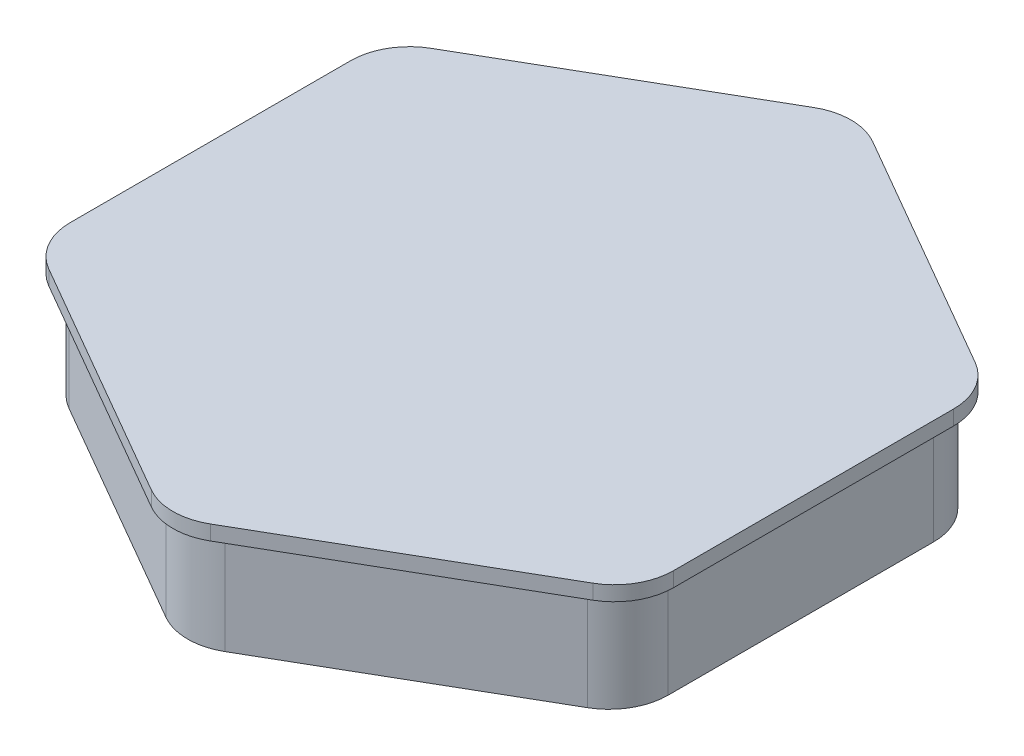
ISO-10303-21;
HEADER;
FILE_DESCRIPTION(('STEP AP214'),'2;1');
FILE_NAME('part.step','',(''),(''),'','','');
FILE_SCHEMA(('AUTOMOTIVE_DESIGN { 1 0 10303 214 1 1 1 1 }'));
ENDSEC;
DATA;
#1=APPLICATION_CONTEXT('core data for automotive mechanical design processes');
#2=APPLICATION_PROTOCOL_DEFINITION('international standard','automotive_design',2000,#1);
#3=PRODUCT_CONTEXT('',#1,'mechanical');
#4=PRODUCT('Part','Part','',(#3));
#5=PRODUCT_RELATED_PRODUCT_CATEGORY('part','',(#4));
#6=PRODUCT_DEFINITION_FORMATION('','',#4);
#7=PRODUCT_DEFINITION_CONTEXT('part definition',#1,'design');
#8=PRODUCT_DEFINITION('design','',#6,#7);
#9=PRODUCT_DEFINITION_SHAPE('','',#8);
#10=(LENGTH_UNIT() NAMED_UNIT(*) SI_UNIT(.MILLI.,.METRE.));
#11=(NAMED_UNIT(*) PLANE_ANGLE_UNIT() SI_UNIT($,.RADIAN.));
#12=(NAMED_UNIT(*) SI_UNIT($,.STERADIAN.) SOLID_ANGLE_UNIT());
#13=UNCERTAINTY_MEASURE_WITH_UNIT(LENGTH_MEASURE(1.E-05),#10,'distance_accuracy_value','');
#14=(GEOMETRIC_REPRESENTATION_CONTEXT(3) GLOBAL_UNCERTAINTY_ASSIGNED_CONTEXT((#13)) GLOBAL_UNIT_ASSIGNED_CONTEXT((#10,
#11,#12)) REPRESENTATION_CONTEXT('',''));
#15=CARTESIAN_POINT('',(0.,0.,0.));
#16=DIRECTION('',(0.,0.,1.));
#17=DIRECTION('',(1.,0.,0.));
#18=AXIS2_PLACEMENT_3D('',#15,#16,#17);
#19=CARTESIAN_POINT('',(23.3826859021798,24.6373706122073,-13.5));
#20=DIRECTION('',(0.,-1.,0.));
#21=DIRECTION('',(0.,0.,-1.));
#22=AXIS2_PLACEMENT_3D('',#19,#20,#21);
#23=CYLINDRICAL_SURFACE('',#22,6.);
#24=CARTESIAN_POINT('',(23.3826859021798,14.1373706122073,-13.5));
#25=DIRECTION('',(0.,1.,0.));
#26=DIRECTION('',(0.,0.,1.));
#27=AXIS2_PLACEMENT_3D('',#24,#25,#26);
#28=CIRCLE('',#27,6.);
#29=CARTESIAN_POINT('',(29.3826859021798,14.1373706122073,-13.5));
#30=VERTEX_POINT('',#29);
#31=CARTESIAN_POINT('',(26.3826859021798,14.1373706122073,-18.6961524227066));
#32=VERTEX_POINT('',#31);
#33=EDGE_CURVE('E179',#30,#32,#28,.T.);
#34=ORIENTED_EDGE('',*,*,#33,.T.);
#35=DIRECTION('',(0.,-1.,0.));
#36=VECTOR('',#35,1.);
#37=CARTESIAN_POINT('',(26.3826859021798,24.6373706122073,-18.6961524227066));
#38=LINE('',#37,#36);
#39=CARTESIAN_POINT('',(26.3826859021798,24.6373706122073,-18.6961524227066));
#40=VERTEX_POINT('',#39);
#41=EDGE_CURVE('E11',#40,#32,#38,.T.);
#42=ORIENTED_EDGE('',*,*,#41,.F.);
#43=CARTESIAN_POINT('',(23.3826859021798,24.6373706122073,-13.5));
#44=DIRECTION('',(0.,1.,0.));
#45=DIRECTION('',(0.,0.,1.));
#46=AXIS2_PLACEMENT_3D('',#43,#44,#45);
#47=CIRCLE('',#46,6.);
#48=CARTESIAN_POINT('',(29.3826859021798,24.6373706122073,-13.5));
#49=VERTEX_POINT('',#48);
#50=EDGE_CURVE('E214',#49,#40,#47,.T.);
#51=ORIENTED_EDGE('',*,*,#50,.F.);
#52=DIRECTION('',(0.,-1.,0.));
#53=VECTOR('',#52,1.);
#54=CARTESIAN_POINT('',(29.3826859021798,24.6373706122073,-13.5));
#55=LINE('',#54,#53);
#56=EDGE_CURVE('E178',#49,#30,#55,.T.);
#57=ORIENTED_EDGE('',*,*,#56,.T.);
#58=EDGE_LOOP('',(#34,#42,#51,#57));
#59=FACE_BOUND('',#58,.T.);
#60=ADVANCED_FACE('F40',(#59),#23,.T.);
#61=CARTESIAN_POINT('',(26.3826859021798,24.6373706122073,-18.6961524227066));
#62=DIRECTION('',(-0.499999999999999,0.,0.866025403784439));
#63=DIRECTION('',(0.866025403784439,0.,0.499999999999999));
#64=AXIS2_PLACEMENT_3D('',#61,#62,#63);
#65=PLANE('',#64);
#66=DIRECTION('',(-0.866025403784439,0.,-0.499999999999999));
#67=VECTOR('',#66,1.);
#68=CARTESIAN_POINT('',(26.3826859021798,14.1373706122073,-18.6961524227066));
#69=LINE('',#68,#67);
#70=CARTESIAN_POINT('',(2.99999999999999,14.1373706122073,-32.1961524227066));
#71=VERTEX_POINT('',#70);
#72=EDGE_CURVE('E183',#32,#71,#69,.T.);
#73=ORIENTED_EDGE('',*,*,#72,.T.);
#74=DIRECTION('',(0.,-1.,0.));
#75=VECTOR('',#74,1.);
#76=CARTESIAN_POINT('',(2.99999999999999,24.6373706122073,-32.1961524227066));
#77=LINE('',#76,#75);
#78=CARTESIAN_POINT('',(2.99999999999999,24.6373706122073,-32.1961524227066));
#79=VERTEX_POINT('',#78);
#80=EDGE_CURVE('E49',#79,#71,#77,.T.);
#81=ORIENTED_EDGE('',*,*,#80,.F.);
#82=DIRECTION('',(-0.866025403784439,0.,-0.499999999999999));
#83=VECTOR('',#82,1.);
#84=CARTESIAN_POINT('',(26.3826859021798,24.6373706122073,-18.6961524227066));
#85=LINE('',#84,#83);
#86=EDGE_CURVE('E111',#40,#79,#85,.T.);
#87=ORIENTED_EDGE('',*,*,#86,.F.);
#88=ORIENTED_EDGE('',*,*,#41,.T.);
#89=EDGE_LOOP('',(#73,#81,#87,#88));
#90=FACE_BOUND('',#89,.T.);
#91=ADVANCED_FACE('F498',(#90),#65,.F.);
#92=CARTESIAN_POINT('',(0.,24.6373706122073,-27.));
#93=DIRECTION('',(0.,-1.,0.));
#94=DIRECTION('',(0.,0.,-1.));
#95=AXIS2_PLACEMENT_3D('',#92,#93,#94);
#96=CYLINDRICAL_SURFACE('',#95,6.);
#97=CARTESIAN_POINT('',(0.,14.1373706122073,-27.));
#98=DIRECTION('',(0.,1.,0.));
#99=DIRECTION('',(0.,0.,-1.));
#100=AXIS2_PLACEMENT_3D('',#97,#98,#99);
#101=CIRCLE('',#100,6.);
#102=CARTESIAN_POINT('',(-3.00000000000001,14.1373706122073,-32.1961524227066));
#103=VERTEX_POINT('',#102);
#104=EDGE_CURVE('E187',#71,#103,#101,.T.);
#105=ORIENTED_EDGE('',*,*,#104,.T.);
#106=DIRECTION('',(0.,-1.,0.));
#107=VECTOR('',#106,1.);
#108=CARTESIAN_POINT('',(-3.00000000000001,24.6373706122073,-32.1961524227066));
#109=LINE('',#108,#107);
#110=CARTESIAN_POINT('',(-3.00000000000001,24.6373706122073,-32.1961524227066));
#111=VERTEX_POINT('',#110);
#112=EDGE_CURVE('E239',#111,#103,#109,.T.);
#113=ORIENTED_EDGE('',*,*,#112,.F.);
#114=CARTESIAN_POINT('',(0.,24.6373706122073,-27.));
#115=DIRECTION('',(0.,1.,0.));
#116=DIRECTION('',(0.,0.,-1.));
#117=AXIS2_PLACEMENT_3D('',#114,#115,#116);
#118=CIRCLE('',#117,6.);
#119=EDGE_CURVE('E249',#79,#111,#118,.T.);
#120=ORIENTED_EDGE('',*,*,#119,.F.);
#121=ORIENTED_EDGE('',*,*,#80,.T.);
#122=EDGE_LOOP('',(#105,#113,#120,#121));
#123=FACE_BOUND('',#122,.T.);
#124=ADVANCED_FACE('F247',(#123),#96,.T.);
#125=CARTESIAN_POINT('',(-3.00000000000001,24.6373706122073,-32.1961524227066));
#126=DIRECTION('',(0.5,0.,0.866025403784439));
#127=DIRECTION('',(0.866025403784439,0.,-0.5));
#128=AXIS2_PLACEMENT_3D('',#125,#126,#127);
#129=PLANE('',#128);
#130=DIRECTION('',(-0.866025403784439,0.,0.5));
#131=VECTOR('',#130,1.);
#132=CARTESIAN_POINT('',(-3.00000000000001,14.1373706122073,-32.1961524227066));
#133=LINE('',#132,#131);
#134=CARTESIAN_POINT('',(-26.3826859021798,14.1373706122073,-18.6961524227066));
#135=VERTEX_POINT('',#134);
#136=EDGE_CURVE('E190',#103,#135,#133,.T.);
#137=ORIENTED_EDGE('',*,*,#136,.T.);
#138=DIRECTION('',(0.,-1.,0.));
#139=VECTOR('',#138,1.);
#140=CARTESIAN_POINT('',(-26.3826859021798,24.6373706122073,-18.6961524227066));
#141=LINE('',#140,#139);
#142=CARTESIAN_POINT('',(-26.3826859021798,24.6373706122073,-18.6961524227066));
#143=VERTEX_POINT('',#142);
#144=EDGE_CURVE('E235',#143,#135,#141,.T.);
#145=ORIENTED_EDGE('',*,*,#144,.F.);
#146=DIRECTION('',(-0.866025403784439,0.,0.5));
#147=VECTOR('',#146,1.);
#148=CARTESIAN_POINT('',(-3.00000000000001,24.6373706122073,-32.1961524227066));
#149=LINE('',#148,#147);
#150=EDGE_CURVE('E269',#111,#143,#149,.T.);
#151=ORIENTED_EDGE('',*,*,#150,.F.);
#152=ORIENTED_EDGE('',*,*,#112,.T.);
#153=EDGE_LOOP('',(#137,#145,#151,#152));
#154=FACE_BOUND('',#153,.T.);
#155=ADVANCED_FACE('F257',(#154),#129,.F.);
#156=CARTESIAN_POINT('',(-23.3826859021798,24.6373706122073,-13.5));
#157=DIRECTION('',(0.,-1.,0.));
#158=DIRECTION('',(0.,0.,-1.));
#159=AXIS2_PLACEMENT_3D('',#156,#157,#158);
#160=CYLINDRICAL_SURFACE('',#159,6.);
#161=CARTESIAN_POINT('',(-23.3826859021798,14.1373706122073,-13.5));
#162=DIRECTION('',(0.,1.,0.));
#163=DIRECTION('',(0.,0.,1.));
#164=AXIS2_PLACEMENT_3D('',#161,#162,#163);
#165=CIRCLE('',#164,6.);
#166=CARTESIAN_POINT('',(-29.3826859021798,14.1373706122073,-13.5));
#167=VERTEX_POINT('',#166);
#168=EDGE_CURVE('E193',#135,#167,#165,.T.);
#169=ORIENTED_EDGE('',*,*,#168,.T.);
#170=DIRECTION('',(0.,-1.,0.));
#171=VECTOR('',#170,1.);
#172=CARTESIAN_POINT('',(-29.3826859021798,24.6373706122073,-13.5));
#173=LINE('',#172,#171);
#174=CARTESIAN_POINT('',(-29.3826859021798,24.6373706122073,-13.5));
#175=VERTEX_POINT('',#174);
#176=EDGE_CURVE('E231',#175,#167,#173,.T.);
#177=ORIENTED_EDGE('',*,*,#176,.F.);
#178=CARTESIAN_POINT('',(-23.3826859021798,24.6373706122073,-13.5));
#179=DIRECTION('',(0.,1.,0.));
#180=DIRECTION('',(0.,0.,1.));
#181=AXIS2_PLACEMENT_3D('',#178,#179,#180);
#182=CIRCLE('',#181,6.);
#183=EDGE_CURVE('E263',#143,#175,#182,.T.);
#184=ORIENTED_EDGE('',*,*,#183,.F.);
#185=ORIENTED_EDGE('',*,*,#144,.T.);
#186=EDGE_LOOP('',(#169,#177,#184,#185));
#187=FACE_BOUND('',#186,.T.);
#188=ADVANCED_FACE('F261',(#187),#160,.T.);
#189=CARTESIAN_POINT('',(-29.3826859021798,24.6373706122073,-13.5));
#190=DIRECTION('',(1.,0.,0.));
#191=DIRECTION('',(0.,0.,-1.));
#192=AXIS2_PLACEMENT_3D('',#189,#190,#191);
#193=PLANE('',#192);
#194=DIRECTION('',(0.,0.,1.));
#195=VECTOR('',#194,1.);
#196=CARTESIAN_POINT('',(-29.3826859021798,14.1373706122073,-13.5));
#197=LINE('',#196,#195);
#198=CARTESIAN_POINT('',(-29.3826859021798,14.1373706122073,13.5));
#199=VERTEX_POINT('',#198);
#200=EDGE_CURVE('E196',#167,#199,#197,.T.);
#201=ORIENTED_EDGE('',*,*,#200,.T.);
#202=DIRECTION('',(0.,-1.,0.));
#203=VECTOR('',#202,1.);
#204=CARTESIAN_POINT('',(-29.3826859021798,24.6373706122073,13.5));
#205=LINE('',#204,#203);
#206=CARTESIAN_POINT('',(-29.3826859021798,24.6373706122073,13.5));
#207=VERTEX_POINT('',#206);
#208=EDGE_CURVE('E227',#207,#199,#205,.T.);
#209=ORIENTED_EDGE('',*,*,#208,.F.);
#210=DIRECTION('',(0.,0.,1.));
#211=VECTOR('',#210,1.);
#212=CARTESIAN_POINT('',(-29.3826859021798,24.6373706122073,-13.5));
#213=LINE('',#212,#211);
#214=EDGE_CURVE('E268',#175,#207,#213,.T.);
#215=ORIENTED_EDGE('',*,*,#214,.F.);
#216=ORIENTED_EDGE('',*,*,#176,.T.);
#217=EDGE_LOOP('',(#201,#209,#215,#216));
#218=FACE_BOUND('',#217,.T.);
#219=ADVANCED_FACE('F511',(#218),#193,.F.);
#220=CARTESIAN_POINT('',(-23.3826859021798,24.6373706122073,13.5));
#221=DIRECTION('',(0.,-1.,0.));
#222=DIRECTION('',(0.,0.,-1.));
#223=AXIS2_PLACEMENT_3D('',#220,#221,#222);
#224=CYLINDRICAL_SURFACE('',#223,6.);
#225=CARTESIAN_POINT('',(-23.3826859021798,14.1373706122073,13.5));
#226=DIRECTION('',(0.,1.,0.));
#227=DIRECTION('',(0.,0.,1.));
#228=AXIS2_PLACEMENT_3D('',#225,#226,#227);
#229=CIRCLE('',#228,6.);
#230=CARTESIAN_POINT('',(-26.3826859021798,14.1373706122073,18.6961524227066));
#231=VERTEX_POINT('',#230);
#232=EDGE_CURVE('E199',#199,#231,#229,.T.);
#233=ORIENTED_EDGE('',*,*,#232,.T.);
#234=DIRECTION('',(0.,-1.,0.));
#235=VECTOR('',#234,1.);
#236=CARTESIAN_POINT('',(-26.3826859021798,24.6373706122073,18.6961524227066));
#237=LINE('',#236,#235);
#238=CARTESIAN_POINT('',(-26.3826859021798,24.6373706122073,18.6961524227066));
#239=VERTEX_POINT('',#238);
#240=EDGE_CURVE('E223',#239,#231,#237,.T.);
#241=ORIENTED_EDGE('',*,*,#240,.F.);
#242=CARTESIAN_POINT('',(-23.3826859021798,24.6373706122073,13.5));
#243=DIRECTION('',(0.,1.,0.));
#244=DIRECTION('',(0.,0.,1.));
#245=AXIS2_PLACEMENT_3D('',#242,#243,#244);
#246=CIRCLE('',#245,6.);
#247=EDGE_CURVE('E169',#207,#239,#246,.T.);
#248=ORIENTED_EDGE('',*,*,#247,.F.);
#249=ORIENTED_EDGE('',*,*,#208,.T.);
#250=EDGE_LOOP('',(#233,#241,#248,#249));
#251=FACE_BOUND('',#250,.T.);
#252=ADVANCED_FACE('F281',(#251),#224,.T.);
#253=CARTESIAN_POINT('',(-26.3826859021798,24.6373706122073,18.6961524227066));
#254=DIRECTION('',(0.499999999999999,0.,-0.866025403784439));
#255=DIRECTION('',(-0.866025403784439,0.,-0.499999999999999));
#256=AXIS2_PLACEMENT_3D('',#253,#254,#255);
#257=PLANE('',#256);
#258=DIRECTION('',(0.866025403784439,0.,0.499999999999999));
#259=VECTOR('',#258,1.);
#260=CARTESIAN_POINT('',(-26.3826859021798,14.1373706122073,18.6961524227066));
#261=LINE('',#260,#259);
#262=CARTESIAN_POINT('',(-2.99999999999998,14.1373706122073,32.1961524227066));
#263=VERTEX_POINT('',#262);
#264=EDGE_CURVE('E202',#231,#263,#261,.T.);
#265=ORIENTED_EDGE('',*,*,#264,.T.);
#266=DIRECTION('',(0.,-1.,0.));
#267=VECTOR('',#266,1.);
#268=CARTESIAN_POINT('',(-2.99999999999998,24.6373706122073,32.1961524227066));
#269=LINE('',#268,#267);
#270=CARTESIAN_POINT('',(-2.99999999999998,24.6373706122073,32.1961524227066));
#271=VERTEX_POINT('',#270);
#272=EDGE_CURVE('E150',#271,#263,#269,.T.);
#273=ORIENTED_EDGE('',*,*,#272,.F.);
#274=DIRECTION('',(0.866025403784439,0.,0.499999999999999));
#275=VECTOR('',#274,1.);
#276=CARTESIAN_POINT('',(-26.3826859021798,24.6373706122073,18.6961524227066));
#277=LINE('',#276,#275);
#278=EDGE_CURVE('E165',#239,#271,#277,.T.);
#279=ORIENTED_EDGE('',*,*,#278,.F.);
#280=ORIENTED_EDGE('',*,*,#240,.T.);
#281=EDGE_LOOP('',(#265,#273,#279,#280));
#282=FACE_BOUND('',#281,.T.);
#283=ADVANCED_FACE('F285',(#282),#257,.F.);
#284=CARTESIAN_POINT('',(0.,24.6373706122073,27.));
#285=DIRECTION('',(0.,-1.,0.));
#286=DIRECTION('',(0.,0.,-1.));
#287=AXIS2_PLACEMENT_3D('',#284,#285,#286);
#288=CYLINDRICAL_SURFACE('',#287,6.);
#289=CARTESIAN_POINT('',(0.,14.1373706122073,27.));
#290=DIRECTION('',(0.,1.,0.));
#291=DIRECTION('',(0.,0.,1.));
#292=AXIS2_PLACEMENT_3D('',#289,#290,#291);
#293=CIRCLE('',#292,6.);
#294=CARTESIAN_POINT('',(3.00000000000002,14.1373706122073,32.1961524227066));
#295=VERTEX_POINT('',#294);
#296=EDGE_CURVE('E146',#263,#295,#293,.T.);
#297=ORIENTED_EDGE('',*,*,#296,.T.);
#298=DIRECTION('',(0.,-1.,0.));
#299=VECTOR('',#298,1.);
#300=CARTESIAN_POINT('',(3.00000000000002,24.6373706122073,32.1961524227066));
#301=LINE('',#300,#299);
#302=CARTESIAN_POINT('',(3.00000000000002,24.6373706122073,32.1961524227066));
#303=VERTEX_POINT('',#302);
#304=EDGE_CURVE('E138',#303,#295,#301,.T.);
#305=ORIENTED_EDGE('',*,*,#304,.F.);
#306=CARTESIAN_POINT('',(0.,24.6373706122073,27.));
#307=DIRECTION('',(0.,1.,0.));
#308=DIRECTION('',(0.,0.,1.));
#309=AXIS2_PLACEMENT_3D('',#306,#307,#308);
#310=CIRCLE('',#309,6.);
#311=EDGE_CURVE('E143',#271,#303,#310,.T.);
#312=ORIENTED_EDGE('',*,*,#311,.F.);
#313=ORIENTED_EDGE('',*,*,#272,.T.);
#314=EDGE_LOOP('',(#297,#305,#312,#313));
#315=FACE_BOUND('',#314,.T.);
#316=ADVANCED_FACE('F140',(#315),#288,.T.);
#317=CARTESIAN_POINT('',(3.00000000000002,24.6373706122073,32.1961524227066));
#318=DIRECTION('',(-0.5,0.,-0.866025403784439));
#319=DIRECTION('',(-0.866025403784439,0.,0.5));
#320=AXIS2_PLACEMENT_3D('',#317,#318,#319);
#321=PLANE('',#320);
#322=DIRECTION('',(0.866025403784439,0.,-0.5));
#323=VECTOR('',#322,1.);
#324=CARTESIAN_POINT('',(3.00000000000002,14.1373706122073,32.1961524227066));
#325=LINE('',#324,#323);
#326=CARTESIAN_POINT('',(26.3826859021798,14.1373706122073,18.6961524227066));
#327=VERTEX_POINT('',#326);
#328=EDGE_CURVE('E207',#295,#327,#325,.T.);
#329=ORIENTED_EDGE('',*,*,#328,.T.);
#330=DIRECTION('',(0.,-1.,0.));
#331=VECTOR('',#330,1.);
#332=CARTESIAN_POINT('',(26.3826859021798,24.6373706122073,18.6961524227066));
#333=LINE('',#332,#331);
#334=CARTESIAN_POINT('',(26.3826859021798,24.6373706122073,18.6961524227066));
#335=VERTEX_POINT('',#334);
#336=EDGE_CURVE('E151',#335,#327,#333,.T.);
#337=ORIENTED_EDGE('',*,*,#336,.F.);
#338=DIRECTION('',(0.866025403784439,0.,-0.5));
#339=VECTOR('',#338,1.);
#340=CARTESIAN_POINT('',(3.00000000000002,24.6373706122073,32.1961524227066));
#341=LINE('',#340,#339);
#342=EDGE_CURVE('E154',#303,#335,#341,.T.);
#343=ORIENTED_EDGE('',*,*,#342,.F.);
#344=ORIENTED_EDGE('',*,*,#304,.T.);
#345=EDGE_LOOP('',(#329,#337,#343,#344));
#346=FACE_BOUND('',#345,.T.);
#347=ADVANCED_FACE('F155',(#346),#321,.F.);
#348=CARTESIAN_POINT('',(23.3826859021798,24.6373706122073,13.5));
#349=DIRECTION('',(0.,-1.,0.));
#350=DIRECTION('',(0.,0.,-1.));
#351=AXIS2_PLACEMENT_3D('',#348,#349,#350);
#352=CYLINDRICAL_SURFACE('',#351,6.);
#353=CARTESIAN_POINT('',(23.3826859021798,14.1373706122073,13.5));
#354=DIRECTION('',(0.,1.,0.));
#355=DIRECTION('',(0.,0.,1.));
#356=AXIS2_PLACEMENT_3D('',#353,#354,#355);
#357=CIRCLE('',#356,6.);
#358=CARTESIAN_POINT('',(29.3826859021798,14.1373706122073,13.5));
#359=VERTEX_POINT('',#358);
#360=EDGE_CURVE('E97',#327,#359,#357,.T.);
#361=ORIENTED_EDGE('',*,*,#360,.T.);
#362=DIRECTION('',(0.,-1.,0.));
#363=VECTOR('',#362,1.);
#364=CARTESIAN_POINT('',(29.3826859021798,24.6373706122073,13.5));
#365=LINE('',#364,#363);
#366=CARTESIAN_POINT('',(29.3826859021798,24.6373706122073,13.5));
#367=VERTEX_POINT('',#366);
#368=EDGE_CURVE('E57',#367,#359,#365,.T.);
#369=ORIENTED_EDGE('',*,*,#368,.F.);
#370=CARTESIAN_POINT('',(23.3826859021798,24.6373706122073,13.5));
#371=DIRECTION('',(0.,1.,0.));
#372=DIRECTION('',(0.,0.,1.));
#373=AXIS2_PLACEMENT_3D('',#370,#371,#372);
#374=CIRCLE('',#373,6.);
#375=EDGE_CURVE('E159',#335,#367,#374,.T.);
#376=ORIENTED_EDGE('',*,*,#375,.F.);
#377=ORIENTED_EDGE('',*,*,#336,.T.);
#378=EDGE_LOOP('',(#361,#369,#376,#377));
#379=FACE_BOUND('',#378,.T.);
#380=ADVANCED_FACE('F286',(#379),#352,.T.);
#381=CARTESIAN_POINT('',(29.3826859021798,24.6373706122073,13.5));
#382=DIRECTION('',(-1.,0.,0.));
#383=DIRECTION('',(0.,0.,1.));
#384=AXIS2_PLACEMENT_3D('',#381,#382,#383);
#385=PLANE('',#384);
#386=DIRECTION('',(0.,0.,-1.));
#387=VECTOR('',#386,1.);
#388=CARTESIAN_POINT('',(29.3826859021798,14.1373706122073,13.5));
#389=LINE('',#388,#387);
#390=EDGE_CURVE('E103',#359,#30,#389,.T.);
#391=ORIENTED_EDGE('',*,*,#390,.T.);
#392=ORIENTED_EDGE('',*,*,#56,.F.);
#393=DIRECTION('',(0.,0.,-1.));
#394=VECTOR('',#393,1.);
#395=CARTESIAN_POINT('',(29.3826859021798,24.6373706122073,13.5));
#396=LINE('',#395,#394);
#397=EDGE_CURVE('E175',#367,#49,#396,.T.);
#398=ORIENTED_EDGE('',*,*,#397,.F.);
#399=ORIENTED_EDGE('',*,*,#368,.T.);
#400=EDGE_LOOP('',(#391,#392,#398,#399));
#401=FACE_BOUND('',#400,.T.);
#402=ADVANCED_FACE('F290',(#401),#385,.F.);
#403=CARTESIAN_POINT('',(23.3826859021798,14.1373706122073,-13.5));
#404=DIRECTION('',(0.,1.,0.));
#405=DIRECTION('',(0.,0.,1.));
#406=AXIS2_PLACEMENT_3D('',#403,#404,#405);
#407=PLANE('',#406);
#408=ORIENTED_EDGE('',*,*,#33,.F.);
#409=ORIENTED_EDGE('',*,*,#390,.F.);
#410=ORIENTED_EDGE('',*,*,#360,.F.);
#411=ORIENTED_EDGE('',*,*,#328,.F.);
#412=ORIENTED_EDGE('',*,*,#296,.F.);
#413=ORIENTED_EDGE('',*,*,#264,.F.);
#414=ORIENTED_EDGE('',*,*,#232,.F.);
#415=ORIENTED_EDGE('',*,*,#200,.F.);
#416=ORIENTED_EDGE('',*,*,#168,.F.);
#417=ORIENTED_EDGE('',*,*,#136,.F.);
#418=ORIENTED_EDGE('',*,*,#104,.F.);
#419=ORIENTED_EDGE('',*,*,#72,.F.);
#420=EDGE_LOOP('',(#408,#409,#410,#411,#412,#413,#414,#415,#416,#417,#418,#419));
#421=FACE_BOUND('',#420,.T.);
#422=ADVANCED_FACE('F253',(#421),#407,.F.);
#423=CARTESIAN_POINT('',(24.6817240078565,24.6373706122073,-14.25));
#424=DIRECTION('',(0.,1.,0.));
#425=DIRECTION('',(0.,0.,1.));
#426=AXIS2_PLACEMENT_3D('',#423,#424,#425);
#427=PLANE('',#426);
#428=CARTESIAN_POINT('',(24.6817240078565,24.6373706122073,-14.25));
#429=DIRECTION('',(0.,1.,0.));
#430=DIRECTION('',(0.,0.,1.));
#431=AXIS2_PLACEMENT_3D('',#428,#429,#430);
#432=CIRCLE('',#431,6.);
#433=CARTESIAN_POINT('',(30.6817240078565,24.6373706122073,-14.25));
#434=VERTEX_POINT('',#433);
#435=CARTESIAN_POINT('',(27.6817240078565,24.6373706122073,-19.4461524227066));
#436=VERTEX_POINT('',#435);
#437=EDGE_CURVE('E389',#434,#436,#432,.T.);
#438=ORIENTED_EDGE('',*,*,#437,.F.);
#439=DIRECTION('',(0.,0.,-1.));
#440=VECTOR('',#439,1.);
#441=CARTESIAN_POINT('',(30.6817240078565,24.6373706122073,14.25));
#442=LINE('',#441,#440);
#443=CARTESIAN_POINT('',(30.6817240078565,24.6373706122073,14.25));
#444=VERTEX_POINT('',#443);
#445=EDGE_CURVE('E344',#444,#434,#442,.T.);
#446=ORIENTED_EDGE('',*,*,#445,.F.);
#447=CARTESIAN_POINT('',(24.6817240078565,24.6373706122073,14.25));
#448=DIRECTION('',(0.,1.,0.));
#449=DIRECTION('',(0.,0.,1.));
#450=AXIS2_PLACEMENT_3D('',#447,#448,#449);
#451=CIRCLE('',#450,6.);
#452=CARTESIAN_POINT('',(27.6817240078565,24.6373706122073,19.4461524227066));
#453=VERTEX_POINT('',#452);
#454=EDGE_CURVE('E349',#453,#444,#451,.T.);
#455=ORIENTED_EDGE('',*,*,#454,.F.);
#456=DIRECTION('',(0.866025403784438,0.,-0.5));
#457=VECTOR('',#456,1.);
#458=CARTESIAN_POINT('',(3.00000000000001,24.6373706122073,33.6961524227066));
#459=LINE('',#458,#457);
#460=CARTESIAN_POINT('',(3.00000000000001,24.6373706122073,33.6961524227066));
#461=VERTEX_POINT('',#460);
#462=EDGE_CURVE('E353',#461,#453,#459,.T.);
#463=ORIENTED_EDGE('',*,*,#462,.F.);
#464=CARTESIAN_POINT('',(0.,24.6373706122073,28.5));
#465=DIRECTION('',(0.,1.,0.));
#466=DIRECTION('',(0.,0.,1.));
#467=AXIS2_PLACEMENT_3D('',#464,#465,#466);
#468=CIRCLE('',#467,6.);
#469=CARTESIAN_POINT('',(-2.99999999999999,24.6373706122073,33.6961524227066));
#470=VERTEX_POINT('',#469);
#471=EDGE_CURVE('E357',#470,#461,#468,.T.);
#472=ORIENTED_EDGE('',*,*,#471,.F.);
#473=DIRECTION('',(0.866025403784439,0.,0.499999999999999));
#474=VECTOR('',#473,1.);
#475=CARTESIAN_POINT('',(-27.6817240078565,24.6373706122073,19.4461524227067));
#476=LINE('',#475,#474);
#477=CARTESIAN_POINT('',(-27.6817240078565,24.6373706122073,19.4461524227067));
#478=VERTEX_POINT('',#477);
#479=EDGE_CURVE('E361',#478,#470,#476,.T.);
#480=ORIENTED_EDGE('',*,*,#479,.F.);
#481=CARTESIAN_POINT('',(-24.6817240078565,24.6373706122073,14.25));
#482=DIRECTION('',(0.,1.,0.));
#483=DIRECTION('',(0.,0.,1.));
#484=AXIS2_PLACEMENT_3D('',#481,#482,#483);
#485=CIRCLE('',#484,6.);
#486=CARTESIAN_POINT('',(-30.6817240078565,24.6373706122073,14.25));
#487=VERTEX_POINT('',#486);
#488=EDGE_CURVE('E365',#487,#478,#485,.T.);
#489=ORIENTED_EDGE('',*,*,#488,.F.);
#490=DIRECTION('',(0.,0.,1.));
#491=VECTOR('',#490,1.);
#492=CARTESIAN_POINT('',(-30.6817240078565,24.6373706122073,-14.25));
#493=LINE('',#492,#491);
#494=CARTESIAN_POINT('',(-30.6817240078565,24.6373706122073,-14.25));
#495=VERTEX_POINT('',#494);
#496=EDGE_CURVE('E369',#495,#487,#493,.T.);
#497=ORIENTED_EDGE('',*,*,#496,.F.);
#498=CARTESIAN_POINT('',(-24.6817240078565,24.6373706122073,-14.25));
#499=DIRECTION('',(0.,1.,0.));
#500=DIRECTION('',(0.,0.,1.));
#501=AXIS2_PLACEMENT_3D('',#498,#499,#500);
#502=CIRCLE('',#501,6.);
#503=CARTESIAN_POINT('',(-27.6817240078565,24.6373706122073,-19.4461524227066));
#504=VERTEX_POINT('',#503);
#505=EDGE_CURVE('E373',#504,#495,#502,.T.);
#506=ORIENTED_EDGE('',*,*,#505,.F.);
#507=DIRECTION('',(-0.866025403784439,0.,0.5));
#508=VECTOR('',#507,1.);
#509=CARTESIAN_POINT('',(-3.,24.6373706122073,-33.6961524227066));
#510=LINE('',#509,#508);
#511=CARTESIAN_POINT('',(-3.,24.6373706122073,-33.6961524227066));
#512=VERTEX_POINT('',#511);
#513=EDGE_CURVE('E377',#512,#504,#510,.T.);
#514=ORIENTED_EDGE('',*,*,#513,.F.);
#515=CARTESIAN_POINT('',(0.,24.6373706122073,-28.5));
#516=DIRECTION('',(0.,1.,0.));
#517=DIRECTION('',(0.,0.,-1.));
#518=AXIS2_PLACEMENT_3D('',#515,#516,#517);
#519=CIRCLE('',#518,6.);
#520=CARTESIAN_POINT('',(2.99999999999999,24.6373706122073,-33.6961524227066));
#521=VERTEX_POINT('',#520);
#522=EDGE_CURVE('E381',#521,#512,#519,.T.);
#523=ORIENTED_EDGE('',*,*,#522,.F.);
#524=DIRECTION('',(-0.866025403784439,0.,-0.499999999999999));
#525=VECTOR('',#524,1.);
#526=CARTESIAN_POINT('',(27.6817240078565,24.6373706122073,-19.4461524227066));
#527=LINE('',#526,#525);
#528=EDGE_CURVE('E385',#436,#521,#527,.T.);
#529=ORIENTED_EDGE('',*,*,#528,.F.);
#530=EDGE_LOOP('',(#438,#446,#455,#463,#472,#480,#489,#497,#506,#514,#523,#529));
#531=FACE_BOUND('',#530,.T.);
#532=ORIENTED_EDGE('',*,*,#397,.T.);
#533=ORIENTED_EDGE('',*,*,#50,.T.);
#534=ORIENTED_EDGE('',*,*,#86,.T.);
#535=ORIENTED_EDGE('',*,*,#119,.T.);
#536=ORIENTED_EDGE('',*,*,#150,.T.);
#537=ORIENTED_EDGE('',*,*,#183,.T.);
#538=ORIENTED_EDGE('',*,*,#214,.T.);
#539=ORIENTED_EDGE('',*,*,#247,.T.);
#540=ORIENTED_EDGE('',*,*,#278,.T.);
#541=ORIENTED_EDGE('',*,*,#311,.T.);
#542=ORIENTED_EDGE('',*,*,#342,.T.);
#543=ORIENTED_EDGE('',*,*,#375,.T.);
#544=EDGE_LOOP('',(#532,#533,#534,#535,#536,#537,#538,#539,#540,#541,#542,#543));
#545=FACE_BOUND('',#544,.T.);
#546=ADVANCED_FACE('F162',(#531,#545),#427,.F.);
#547=CARTESIAN_POINT('',(24.6817240078565,26.1373706122073,-14.25));
#548=DIRECTION('',(0.,-1.,0.));
#549=DIRECTION('',(0.,0.,-1.));
#550=AXIS2_PLACEMENT_3D('',#547,#548,#549);
#551=CYLINDRICAL_SURFACE('',#550,6.);
#552=ORIENTED_EDGE('',*,*,#437,.T.);
#553=DIRECTION('',(0.,-1.,0.));
#554=VECTOR('',#553,1.);
#555=CARTESIAN_POINT('',(27.6817240078565,26.1373706122073,-19.4461524227066));
#556=LINE('',#555,#554);
#557=CARTESIAN_POINT('',(27.6817240078565,26.1373706122073,-19.4461524227066));
#558=VERTEX_POINT('',#557);
#559=EDGE_CURVE('E184',#558,#436,#556,.T.);
#560=ORIENTED_EDGE('',*,*,#559,.F.);
#561=CARTESIAN_POINT('',(24.6817240078565,26.1373706122073,-14.25));
#562=DIRECTION('',(0.,1.,0.));
#563=DIRECTION('',(0.,0.,1.));
#564=AXIS2_PLACEMENT_3D('',#561,#562,#563);
#565=CIRCLE('',#564,6.);
#566=CARTESIAN_POINT('',(30.6817240078565,26.1373706122073,-14.25));
#567=VERTEX_POINT('',#566);
#568=EDGE_CURVE('E348',#567,#558,#565,.T.);
#569=ORIENTED_EDGE('',*,*,#568,.F.);
#570=DIRECTION('',(0.,-1.,0.));
#571=VECTOR('',#570,1.);
#572=CARTESIAN_POINT('',(30.6817240078565,26.1373706122073,-14.25));
#573=LINE('',#572,#571);
#574=EDGE_CURVE('E339',#567,#434,#573,.T.);
#575=ORIENTED_EDGE('',*,*,#574,.T.);
#576=EDGE_LOOP('',(#552,#560,#569,#575));
#577=FACE_BOUND('',#576,.T.);
#578=ADVANCED_FACE('F451',(#577),#551,.T.);
#579=CARTESIAN_POINT('',(27.6817240078565,26.1373706122073,-19.4461524227066));
#580=DIRECTION('',(-0.499999999999999,0.,0.866025403784439));
#581=DIRECTION('',(0.866025403784439,0.,0.499999999999999));
#582=AXIS2_PLACEMENT_3D('',#579,#580,#581);
#583=PLANE('',#582);
#584=ORIENTED_EDGE('',*,*,#528,.T.);
#585=DIRECTION('',(0.,-1.,0.));
#586=VECTOR('',#585,1.);
#587=CARTESIAN_POINT('',(2.99999999999999,26.1373706122073,-33.6961524227066));
#588=LINE('',#587,#586);
#589=CARTESIAN_POINT('',(2.99999999999999,26.1373706122073,-33.6961524227066));
#590=VERTEX_POINT('',#589);
#591=EDGE_CURVE('E299',#590,#521,#588,.T.);
#592=ORIENTED_EDGE('',*,*,#591,.F.);
#593=DIRECTION('',(-0.866025403784439,0.,-0.499999999999999));
#594=VECTOR('',#593,1.);
#595=CARTESIAN_POINT('',(27.6817240078565,26.1373706122073,-19.4461524227066));
#596=LINE('',#595,#594);
#597=EDGE_CURVE('E432',#558,#590,#596,.T.);
#598=ORIENTED_EDGE('',*,*,#597,.F.);
#599=ORIENTED_EDGE('',*,*,#559,.T.);
#600=EDGE_LOOP('',(#584,#592,#598,#599));
#601=FACE_BOUND('',#600,.T.);
#602=ADVANCED_FACE('F455',(#601),#583,.F.);
#603=CARTESIAN_POINT('',(0.,26.1373706122073,-28.5));
#604=DIRECTION('',(0.,-1.,0.));
#605=DIRECTION('',(0.,0.,-1.));
#606=AXIS2_PLACEMENT_3D('',#603,#604,#605);
#607=CYLINDRICAL_SURFACE('',#606,6.);
#608=ORIENTED_EDGE('',*,*,#522,.T.);
#609=DIRECTION('',(0.,-1.,0.));
#610=VECTOR('',#609,1.);
#611=CARTESIAN_POINT('',(-3.,26.1373706122073,-33.6961524227066));
#612=LINE('',#611,#610);
#613=CARTESIAN_POINT('',(-3.,26.1373706122073,-33.6961524227066));
#614=VERTEX_POINT('',#613);
#615=EDGE_CURVE('E303',#614,#512,#612,.T.);
#616=ORIENTED_EDGE('',*,*,#615,.F.);
#617=CARTESIAN_POINT('',(0.,26.1373706122073,-28.5));
#618=DIRECTION('',(0.,1.,0.));
#619=DIRECTION('',(0.,0.,-1.));
#620=AXIS2_PLACEMENT_3D('',#617,#618,#619);
#621=CIRCLE('',#620,6.);
#622=EDGE_CURVE('E428',#590,#614,#621,.T.);
#623=ORIENTED_EDGE('',*,*,#622,.F.);
#624=ORIENTED_EDGE('',*,*,#591,.T.);
#625=EDGE_LOOP('',(#608,#616,#623,#624));
#626=FACE_BOUND('',#625,.T.);
#627=ADVANCED_FACE('F529',(#626),#607,.T.);
#628=CARTESIAN_POINT('',(-3.,26.1373706122073,-33.6961524227066));
#629=DIRECTION('',(0.5,0.,0.866025403784439));
#630=DIRECTION('',(0.866025403784439,0.,-0.5));
#631=AXIS2_PLACEMENT_3D('',#628,#629,#630);
#632=PLANE('',#631);
#633=ORIENTED_EDGE('',*,*,#513,.T.);
#634=DIRECTION('',(0.,-1.,0.));
#635=VECTOR('',#634,1.);
#636=CARTESIAN_POINT('',(-27.6817240078565,26.1373706122073,-19.4461524227066));
#637=LINE('',#636,#635);
#638=CARTESIAN_POINT('',(-27.6817240078565,26.1373706122073,-19.4461524227066));
#639=VERTEX_POINT('',#638);
#640=EDGE_CURVE('E307',#639,#504,#637,.T.);
#641=ORIENTED_EDGE('',*,*,#640,.F.);
#642=DIRECTION('',(-0.866025403784439,0.,0.5));
#643=VECTOR('',#642,1.);
#644=CARTESIAN_POINT('',(-3.,26.1373706122073,-33.6961524227066));
#645=LINE('',#644,#643);
#646=EDGE_CURVE('E424',#614,#639,#645,.T.);
#647=ORIENTED_EDGE('',*,*,#646,.F.);
#648=ORIENTED_EDGE('',*,*,#615,.T.);
#649=EDGE_LOOP('',(#633,#641,#647,#648));
#650=FACE_BOUND('',#649,.T.);
#651=ADVANCED_FACE('F532',(#650),#632,.F.);
#652=CARTESIAN_POINT('',(-24.6817240078565,26.1373706122073,-14.25));
#653=DIRECTION('',(0.,-1.,0.));
#654=DIRECTION('',(0.,0.,-1.));
#655=AXIS2_PLACEMENT_3D('',#652,#653,#654);
#656=CYLINDRICAL_SURFACE('',#655,6.);
#657=ORIENTED_EDGE('',*,*,#505,.T.);
#658=DIRECTION('',(0.,-1.,0.));
#659=VECTOR('',#658,1.);
#660=CARTESIAN_POINT('',(-30.6817240078565,26.1373706122073,-14.25));
#661=LINE('',#660,#659);
#662=CARTESIAN_POINT('',(-30.6817240078565,26.1373706122073,-14.25));
#663=VERTEX_POINT('',#662);
#664=EDGE_CURVE('E311',#663,#495,#661,.T.);
#665=ORIENTED_EDGE('',*,*,#664,.F.);
#666=CARTESIAN_POINT('',(-24.6817240078565,26.1373706122073,-14.25));
#667=DIRECTION('',(0.,1.,0.));
#668=DIRECTION('',(0.,0.,1.));
#669=AXIS2_PLACEMENT_3D('',#666,#667,#668);
#670=CIRCLE('',#669,6.);
#671=EDGE_CURVE('E420',#639,#663,#670,.T.);
#672=ORIENTED_EDGE('',*,*,#671,.F.);
#673=ORIENTED_EDGE('',*,*,#640,.T.);
#674=EDGE_LOOP('',(#657,#665,#672,#673));
#675=FACE_BOUND('',#674,.T.);
#676=ADVANCED_FACE('F536',(#675),#656,.T.);
#677=CARTESIAN_POINT('',(-30.6817240078565,26.1373706122073,-14.25));
#678=DIRECTION('',(1.,0.,0.));
#679=DIRECTION('',(0.,0.,-1.));
#680=AXIS2_PLACEMENT_3D('',#677,#678,#679);
#681=PLANE('',#680);
#682=ORIENTED_EDGE('',*,*,#496,.T.);
#683=DIRECTION('',(0.,-1.,0.));
#684=VECTOR('',#683,1.);
#685=CARTESIAN_POINT('',(-30.6817240078565,26.1373706122073,14.25));
#686=LINE('',#685,#684);
#687=CARTESIAN_POINT('',(-30.6817240078565,26.1373706122073,14.25));
#688=VERTEX_POINT('',#687);
#689=EDGE_CURVE('E315',#688,#487,#686,.T.);
#690=ORIENTED_EDGE('',*,*,#689,.F.);
#691=DIRECTION('',(0.,0.,1.));
#692=VECTOR('',#691,1.);
#693=CARTESIAN_POINT('',(-30.6817240078565,26.1373706122073,-14.25));
#694=LINE('',#693,#692);
#695=EDGE_CURVE('E416',#663,#688,#694,.T.);
#696=ORIENTED_EDGE('',*,*,#695,.F.);
#697=ORIENTED_EDGE('',*,*,#664,.T.);
#698=EDGE_LOOP('',(#682,#690,#696,#697));
#699=FACE_BOUND('',#698,.T.);
#700=ADVANCED_FACE('F540',(#699),#681,.F.);
#701=CARTESIAN_POINT('',(-24.6817240078565,26.1373706122073,14.25));
#702=DIRECTION('',(0.,-1.,0.));
#703=DIRECTION('',(0.,0.,-1.));
#704=AXIS2_PLACEMENT_3D('',#701,#702,#703);
#705=CYLINDRICAL_SURFACE('',#704,6.);
#706=ORIENTED_EDGE('',*,*,#488,.T.);
#707=DIRECTION('',(0.,-1.,0.));
#708=VECTOR('',#707,1.);
#709=CARTESIAN_POINT('',(-27.6817240078565,26.1373706122073,19.4461524227067));
#710=LINE('',#709,#708);
#711=CARTESIAN_POINT('',(-27.6817240078565,26.1373706122073,19.4461524227067));
#712=VERTEX_POINT('',#711);
#713=EDGE_CURVE('E319',#712,#478,#710,.T.);
#714=ORIENTED_EDGE('',*,*,#713,.F.);
#715=CARTESIAN_POINT('',(-24.6817240078565,26.1373706122073,14.25));
#716=DIRECTION('',(0.,1.,0.));
#717=DIRECTION('',(0.,0.,1.));
#718=AXIS2_PLACEMENT_3D('',#715,#716,#717);
#719=CIRCLE('',#718,6.);
#720=EDGE_CURVE('E412',#688,#712,#719,.T.);
#721=ORIENTED_EDGE('',*,*,#720,.F.);
#722=ORIENTED_EDGE('',*,*,#689,.T.);
#723=EDGE_LOOP('',(#706,#714,#721,#722));
#724=FACE_BOUND('',#723,.T.);
#725=ADVANCED_FACE('F544',(#724),#705,.T.);
#726=CARTESIAN_POINT('',(-27.6817240078565,26.1373706122073,19.4461524227067));
#727=DIRECTION('',(0.499999999999999,0.,-0.866025403784439));
#728=DIRECTION('',(-0.866025403784439,0.,-0.499999999999999));
#729=AXIS2_PLACEMENT_3D('',#726,#727,#728);
#730=PLANE('',#729);
#731=ORIENTED_EDGE('',*,*,#479,.T.);
#732=DIRECTION('',(0.,-1.,0.));
#733=VECTOR('',#732,1.);
#734=CARTESIAN_POINT('',(-2.99999999999999,26.1373706122073,33.6961524227066));
#735=LINE('',#734,#733);
#736=CARTESIAN_POINT('',(-2.99999999999999,26.1373706122073,33.6961524227066));
#737=VERTEX_POINT('',#736);
#738=EDGE_CURVE('E323',#737,#470,#735,.T.);
#739=ORIENTED_EDGE('',*,*,#738,.F.);
#740=DIRECTION('',(0.866025403784439,0.,0.499999999999999));
#741=VECTOR('',#740,1.);
#742=CARTESIAN_POINT('',(-27.6817240078565,26.1373706122073,19.4461524227067));
#743=LINE('',#742,#741);
#744=EDGE_CURVE('E408',#712,#737,#743,.T.);
#745=ORIENTED_EDGE('',*,*,#744,.F.);
#746=ORIENTED_EDGE('',*,*,#713,.T.);
#747=EDGE_LOOP('',(#731,#739,#745,#746));
#748=FACE_BOUND('',#747,.T.);
#749=ADVANCED_FACE('F548',(#748),#730,.F.);
#750=CARTESIAN_POINT('',(0.,26.1373706122073,28.5));
#751=DIRECTION('',(0.,-1.,0.));
#752=DIRECTION('',(0.,0.,-1.));
#753=AXIS2_PLACEMENT_3D('',#750,#751,#752);
#754=CYLINDRICAL_SURFACE('',#753,6.);
#755=ORIENTED_EDGE('',*,*,#471,.T.);
#756=DIRECTION('',(0.,-1.,0.));
#757=VECTOR('',#756,1.);
#758=CARTESIAN_POINT('',(3.00000000000001,26.1373706122073,33.6961524227066));
#759=LINE('',#758,#757);
#760=CARTESIAN_POINT('',(3.00000000000001,26.1373706122073,33.6961524227066));
#761=VERTEX_POINT('',#760);
#762=EDGE_CURVE('E327',#761,#461,#759,.T.);
#763=ORIENTED_EDGE('',*,*,#762,.F.);
#764=CARTESIAN_POINT('',(0.,26.1373706122073,28.5));
#765=DIRECTION('',(0.,1.,0.));
#766=DIRECTION('',(0.,0.,1.));
#767=AXIS2_PLACEMENT_3D('',#764,#765,#766);
#768=CIRCLE('',#767,6.);
#769=EDGE_CURVE('E404',#737,#761,#768,.T.);
#770=ORIENTED_EDGE('',*,*,#769,.F.);
#771=ORIENTED_EDGE('',*,*,#738,.T.);
#772=EDGE_LOOP('',(#755,#763,#770,#771));
#773=FACE_BOUND('',#772,.T.);
#774=ADVANCED_FACE('F552',(#773),#754,.T.);
#775=CARTESIAN_POINT('',(3.00000000000001,26.1373706122073,33.6961524227066));
#776=DIRECTION('',(-0.5,0.,-0.866025403784439));
#777=DIRECTION('',(-0.866025403784439,0.,0.5));
#778=AXIS2_PLACEMENT_3D('',#775,#776,#777);
#779=PLANE('',#778);
#780=ORIENTED_EDGE('',*,*,#462,.T.);
#781=DIRECTION('',(0.,-1.,0.));
#782=VECTOR('',#781,1.);
#783=CARTESIAN_POINT('',(27.6817240078565,26.1373706122073,19.4461524227066));
#784=LINE('',#783,#782);
#785=CARTESIAN_POINT('',(27.6817240078565,26.1373706122073,19.4461524227066));
#786=VERTEX_POINT('',#785);
#787=EDGE_CURVE('E331',#786,#453,#784,.T.);
#788=ORIENTED_EDGE('',*,*,#787,.F.);
#789=DIRECTION('',(0.866025403784438,0.,-0.5));
#790=VECTOR('',#789,1.);
#791=CARTESIAN_POINT('',(3.00000000000001,26.1373706122073,33.6961524227066));
#792=LINE('',#791,#790);
#793=EDGE_CURVE('E400',#761,#786,#792,.T.);
#794=ORIENTED_EDGE('',*,*,#793,.F.);
#795=ORIENTED_EDGE('',*,*,#762,.T.);
#796=EDGE_LOOP('',(#780,#788,#794,#795));
#797=FACE_BOUND('',#796,.T.);
#798=ADVANCED_FACE('F556',(#797),#779,.F.);
#799=CARTESIAN_POINT('',(24.6817240078565,26.1373706122073,14.25));
#800=DIRECTION('',(0.,-1.,0.));
#801=DIRECTION('',(0.,0.,-1.));
#802=AXIS2_PLACEMENT_3D('',#799,#800,#801);
#803=CYLINDRICAL_SURFACE('',#802,6.);
#804=ORIENTED_EDGE('',*,*,#454,.T.);
#805=DIRECTION('',(0.,-1.,0.));
#806=VECTOR('',#805,1.);
#807=CARTESIAN_POINT('',(30.6817240078565,26.1373706122073,14.25));
#808=LINE('',#807,#806);
#809=CARTESIAN_POINT('',(30.6817240078565,26.1373706122073,14.25));
#810=VERTEX_POINT('',#809);
#811=EDGE_CURVE('E335',#810,#444,#808,.T.);
#812=ORIENTED_EDGE('',*,*,#811,.F.);
#813=CARTESIAN_POINT('',(24.6817240078565,26.1373706122073,14.25));
#814=DIRECTION('',(0.,1.,0.));
#815=DIRECTION('',(0.,0.,1.));
#816=AXIS2_PLACEMENT_3D('',#813,#814,#815);
#817=CIRCLE('',#816,6.);
#818=EDGE_CURVE('E396',#786,#810,#817,.T.);
#819=ORIENTED_EDGE('',*,*,#818,.F.);
#820=ORIENTED_EDGE('',*,*,#787,.T.);
#821=EDGE_LOOP('',(#804,#812,#819,#820));
#822=FACE_BOUND('',#821,.T.);
#823=ADVANCED_FACE('F560',(#822),#803,.T.);
#824=CARTESIAN_POINT('',(30.6817240078565,26.1373706122073,14.25));
#825=DIRECTION('',(-1.,0.,0.));
#826=DIRECTION('',(0.,0.,1.));
#827=AXIS2_PLACEMENT_3D('',#824,#825,#826);
#828=PLANE('',#827);
#829=ORIENTED_EDGE('',*,*,#445,.T.);
#830=ORIENTED_EDGE('',*,*,#574,.F.);
#831=DIRECTION('',(0.,0.,-1.));
#832=VECTOR('',#831,1.);
#833=CARTESIAN_POINT('',(30.6817240078565,26.1373706122073,14.25));
#834=LINE('',#833,#832);
#835=EDGE_CURVE('E343',#810,#567,#834,.T.);
#836=ORIENTED_EDGE('',*,*,#835,.F.);
#837=ORIENTED_EDGE('',*,*,#811,.T.);
#838=EDGE_LOOP('',(#829,#830,#836,#837));
#839=FACE_BOUND('',#838,.T.);
#840=ADVANCED_FACE('F484',(#839),#828,.F.);
#841=CARTESIAN_POINT('',(24.6817240078565,26.1373706122073,-14.25));
#842=DIRECTION('',(0.,1.,0.));
#843=DIRECTION('',(0.,0.,1.));
#844=AXIS2_PLACEMENT_3D('',#841,#842,#843);
#845=PLANE('',#844);
#846=ORIENTED_EDGE('',*,*,#568,.T.);
#847=ORIENTED_EDGE('',*,*,#597,.T.);
#848=ORIENTED_EDGE('',*,*,#622,.T.);
#849=ORIENTED_EDGE('',*,*,#646,.T.);
#850=ORIENTED_EDGE('',*,*,#671,.T.);
#851=ORIENTED_EDGE('',*,*,#695,.T.);
#852=ORIENTED_EDGE('',*,*,#720,.T.);
#853=ORIENTED_EDGE('',*,*,#744,.T.);
#854=ORIENTED_EDGE('',*,*,#769,.T.);
#855=ORIENTED_EDGE('',*,*,#793,.T.);
#856=ORIENTED_EDGE('',*,*,#818,.T.);
#857=ORIENTED_EDGE('',*,*,#835,.T.);
#858=EDGE_LOOP('',(#846,#847,#848,#849,#850,#851,#852,#853,#854,#855,#856,#857));
#859=FACE_BOUND('',#858,.T.);
#860=ADVANCED_FACE('F442',(#859),#845,.T.);
#861=CLOSED_SHELL('',(#60,#91,#124,#155,#188,#219,#252,#283,#316,#347,#380,#402,#422,#546,#578,
#602,#627,#651,#676,#700,#725,#749,#774,#798,#823,#840,#860));
#862=MANIFOLD_SOLID_BREP('B2',#861);
#863=ADVANCED_BREP_SHAPE_REPRESENTATION('',(#18,#862),#14);
#864=SHAPE_DEFINITION_REPRESENTATION(#9,#863);
ENDSEC;
END-ISO-10303-21;
